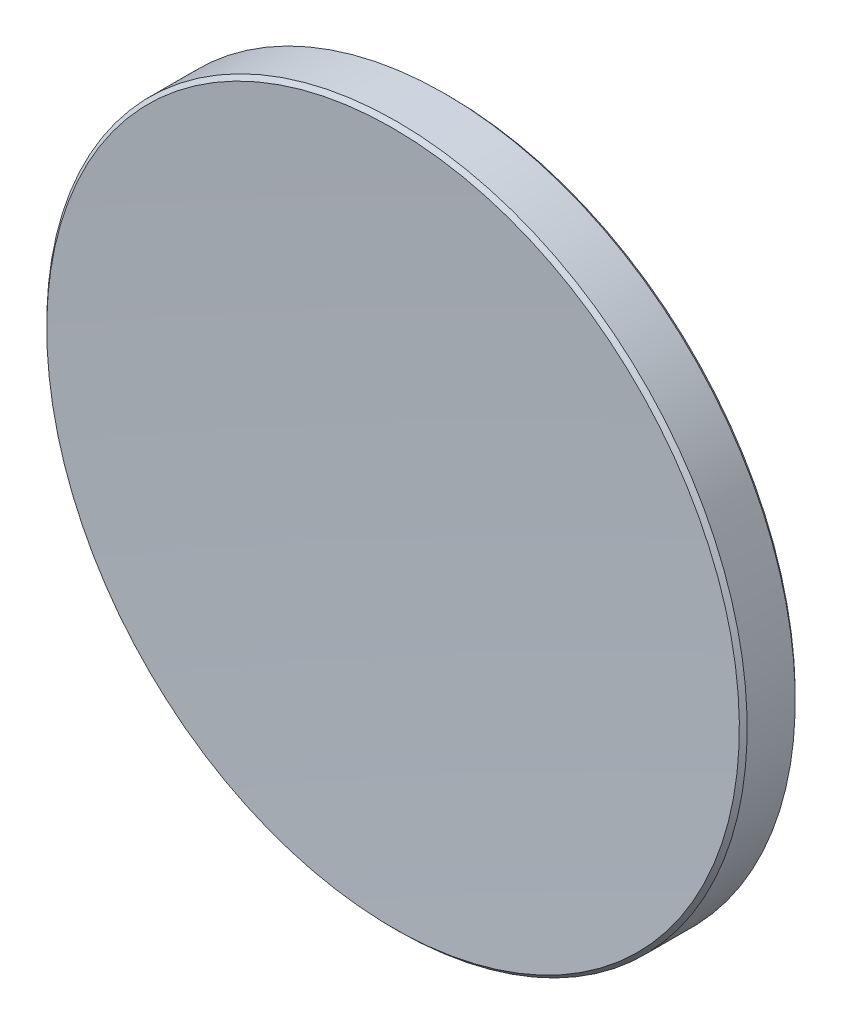
ISO-10303-21;
HEADER;
FILE_DESCRIPTION(('STEP AP214'),'2;1');
FILE_NAME('part.step','',(''),(''),'','','');
FILE_SCHEMA(('AUTOMOTIVE_DESIGN { 1 0 10303 214 1 1 1 1 }'));
ENDSEC;
DATA;
#1=APPLICATION_CONTEXT('core data for automotive mechanical design processes');
#2=APPLICATION_PROTOCOL_DEFINITION('international standard','automotive_design',2000,#1);
#3=PRODUCT_CONTEXT('',#1,'mechanical');
#4=PRODUCT('Part','Part','',(#3));
#5=PRODUCT_RELATED_PRODUCT_CATEGORY('part','',(#4));
#6=PRODUCT_DEFINITION_FORMATION('','',#4);
#7=PRODUCT_DEFINITION_CONTEXT('part definition',#1,'design');
#8=PRODUCT_DEFINITION('design','',#6,#7);
#9=PRODUCT_DEFINITION_SHAPE('','',#8);
#10=(LENGTH_UNIT() NAMED_UNIT(*) SI_UNIT(.MILLI.,.METRE.));
#11=(NAMED_UNIT(*) PLANE_ANGLE_UNIT() SI_UNIT($,.RADIAN.));
#12=(NAMED_UNIT(*) SI_UNIT($,.STERADIAN.) SOLID_ANGLE_UNIT());
#13=UNCERTAINTY_MEASURE_WITH_UNIT(LENGTH_MEASURE(1.E-05),#10,'distance_accuracy_value','');
#14=(GEOMETRIC_REPRESENTATION_CONTEXT(3) GLOBAL_UNCERTAINTY_ASSIGNED_CONTEXT((#13)) GLOBAL_UNIT_ASSIGNED_CONTEXT((#10,
#11,#12)) REPRESENTATION_CONTEXT('',''));
#15=CARTESIAN_POINT('',(0.,0.,0.));
#16=DIRECTION('',(0.,0.,1.));
#17=DIRECTION('',(1.,0.,0.));
#18=AXIS2_PLACEMENT_3D('',#15,#16,#17);
#19=CARTESIAN_POINT('',(0.,0.,331.9));
#20=DIRECTION('',(0.,0.,-1.));
#21=DIRECTION('',(0.,1.,0.));
#22=AXIS2_PLACEMENT_3D('',#19,#20,#21);
#23=SPHERICAL_SURFACE('',#22,330.6);
#24=CARTESIAN_POINT('',(0.,0.,1.53861893004442));
#25=DIRECTION('',(0.,0.,-1.));
#26=DIRECTION('',(0.,1.,0.));
#27=AXIS2_PLACEMENT_3D('',#24,#25,#26);
#28=CIRCLE('',#27,12.5585786437627);
#29=CARTESIAN_POINT('',(0.,12.5585786437627,1.53861893004442));
#30=VERTEX_POINT('',#29);
#31=EDGE_CURVE('E27',#30,#30,#28,.T.);
#32=ORIENTED_EDGE('',*,*,#31,.F.);
#33=EDGE_LOOP('',(#32));
#34=FACE_BOUND('',#33,.T.);
#35=ADVANCED_FACE('F13',(#34),#23,.F.);
#36=CARTESIAN_POINT('',(0.,0.,96.3));
#37=DIRECTION('',(0.,0.,-1.));
#38=DIRECTION('',(0.,1.,0.));
#39=AXIS2_PLACEMENT_3D('',#36,#37,#38);
#40=SPHERICAL_SURFACE('',#39,97.6);
#41=CARTESIAN_POINT('',(0.,0.,-0.488646557581462));
#42=DIRECTION('',(0.,0.,-1.));
#43=DIRECTION('',(0.,1.,0.));
#44=AXIS2_PLACEMENT_3D('',#41,#42,#43);
#45=CIRCLE('',#44,12.5585786437627);
#46=CARTESIAN_POINT('',(0.,12.5585786437627,-0.488646557581462));
#47=VERTEX_POINT('',#46);
#48=EDGE_CURVE('E9',#47,#47,#45,.T.);
#49=ORIENTED_EDGE('',*,*,#48,.T.);
#50=EDGE_LOOP('',(#49));
#51=FACE_BOUND('',#50,.T.);
#52=ADVANCED_FACE('F37',(#51),#40,.T.);
#53=CARTESIAN_POINT('',(0.,0.,-0.488646557581462));
#54=DIRECTION('',(0.,0.,1.));
#55=DIRECTION('',(0.,-1.,0.));
#56=AXIS2_PLACEMENT_3D('',#53,#54,#55);
#57=CONICAL_SURFACE('',#56,12.5585786437627,0.785398163397455);
#58=CARTESIAN_POINT('',(0.,0.,-0.347225201344155));
#59=DIRECTION('',(0.,0.,-1.));
#60=DIRECTION('',(0.,1.,0.));
#61=AXIS2_PLACEMENT_3D('',#58,#59,#60);
#62=CIRCLE('',#61,12.7);
#63=CARTESIAN_POINT('',(0.,12.7,-0.347225201344155));
#64=VERTEX_POINT('',#63);
#65=EDGE_CURVE('E19',#64,#64,#62,.T.);
#66=ORIENTED_EDGE('',*,*,#65,.T.);
#67=EDGE_LOOP('',(#66));
#68=FACE_BOUND('',#67,.T.);
#69=ORIENTED_EDGE('',*,*,#48,.F.);
#70=EDGE_LOOP('',(#69));
#71=FACE_BOUND('',#70,.T.);
#72=ADVANCED_FACE('F43',(#68,#71),#57,.T.);
#73=CARTESIAN_POINT('',(0.,0.,-1.3));
#74=DIRECTION('',(0.,0.,-1.));
#75=DIRECTION('',(0.,1.,0.));
#76=AXIS2_PLACEMENT_3D('',#73,#74,#75);
#77=CYLINDRICAL_SURFACE('',#76,12.7);
#78=CARTESIAN_POINT('',(0.,0.,1.39719757380711));
#79=DIRECTION('',(0.,0.,-1.));
#80=DIRECTION('',(0.,1.,0.));
#81=AXIS2_PLACEMENT_3D('',#78,#79,#80);
#82=CIRCLE('',#81,12.7);
#83=CARTESIAN_POINT('',(0.,12.7,1.39719757380711));
#84=VERTEX_POINT('',#83);
#85=EDGE_CURVE('E23',#84,#84,#82,.T.);
#86=ORIENTED_EDGE('',*,*,#85,.T.);
#87=EDGE_LOOP('',(#86));
#88=FACE_BOUND('',#87,.T.);
#89=ORIENTED_EDGE('',*,*,#65,.F.);
#90=EDGE_LOOP('',(#89));
#91=FACE_BOUND('',#90,.T.);
#92=ADVANCED_FACE('F48',(#88,#91),#77,.T.);
#93=CARTESIAN_POINT('',(0.,0.,1.39719757380711));
#94=DIRECTION('',(0.,0.,-1.));
#95=DIRECTION('',(0.,1.,0.));
#96=AXIS2_PLACEMENT_3D('',#93,#94,#95);
#97=CONICAL_SURFACE('',#96,12.7,0.78539816339745);
#98=ORIENTED_EDGE('',*,*,#31,.T.);
#99=EDGE_LOOP('',(#98));
#100=FACE_BOUND('',#99,.T.);
#101=ORIENTED_EDGE('',*,*,#85,.F.);
#102=EDGE_LOOP('',(#101));
#103=FACE_BOUND('',#102,.T.);
#104=ADVANCED_FACE('F33',(#100,#103),#97,.T.);
#105=CLOSED_SHELL('',(#35,#52,#72,#92,#104));
#106=MANIFOLD_SOLID_BREP('B1',#105);
#107=ADVANCED_BREP_SHAPE_REPRESENTATION('',(#18,#106),#14);
#108=SHAPE_DEFINITION_REPRESENTATION(#9,#107);
ENDSEC;
END-ISO-10303-21;
